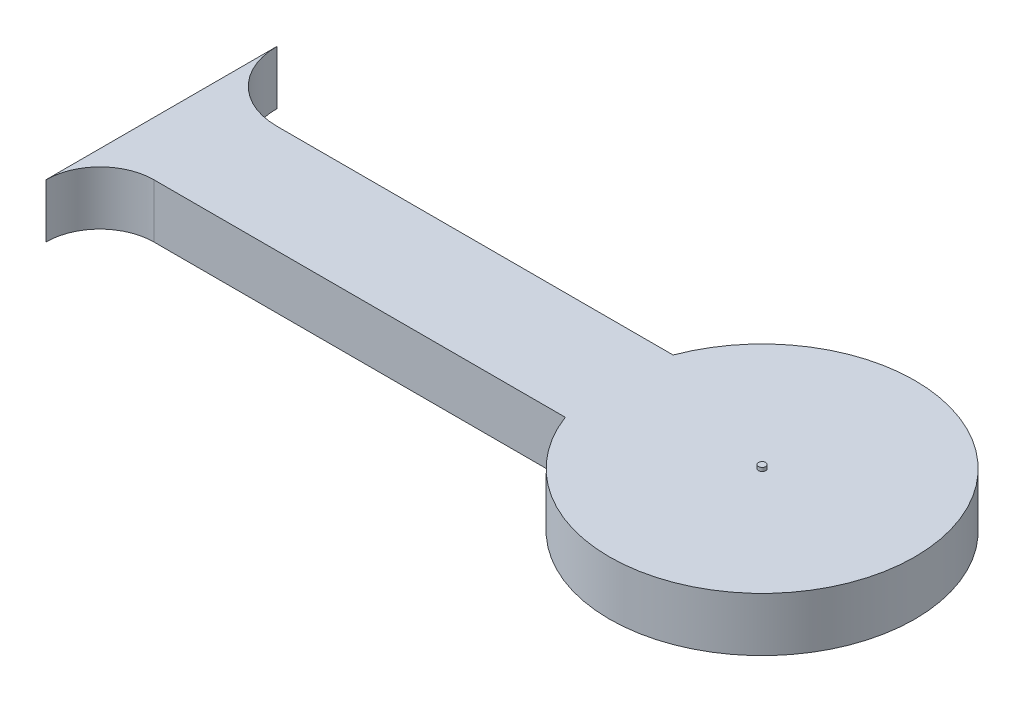
ISO-10303-21;
HEADER;
FILE_DESCRIPTION(('STEP AP214'),'2;1');
FILE_NAME('part.step','',(''),(''),'','','');
FILE_SCHEMA(('AUTOMOTIVE_DESIGN { 1 0 10303 214 1 1 1 1 }'));
ENDSEC;
DATA;
#1=APPLICATION_CONTEXT('core data for automotive mechanical design processes');
#2=APPLICATION_PROTOCOL_DEFINITION('international standard','automotive_design',2000,#1);
#3=PRODUCT_CONTEXT('',#1,'mechanical');
#4=PRODUCT('Part','Part','',(#3));
#5=PRODUCT_RELATED_PRODUCT_CATEGORY('part','',(#4));
#6=PRODUCT_DEFINITION_FORMATION('','',#4);
#7=PRODUCT_DEFINITION_CONTEXT('part definition',#1,'design');
#8=PRODUCT_DEFINITION('design','',#6,#7);
#9=PRODUCT_DEFINITION_SHAPE('','',#8);
#10=(LENGTH_UNIT() NAMED_UNIT(*) SI_UNIT(.MILLI.,.METRE.));
#11=(NAMED_UNIT(*) PLANE_ANGLE_UNIT() SI_UNIT($,.RADIAN.));
#12=(NAMED_UNIT(*) SI_UNIT($,.STERADIAN.) SOLID_ANGLE_UNIT());
#13=UNCERTAINTY_MEASURE_WITH_UNIT(LENGTH_MEASURE(1.E-05),#10,'distance_accuracy_value','');
#14=(GEOMETRIC_REPRESENTATION_CONTEXT(3) GLOBAL_UNCERTAINTY_ASSIGNED_CONTEXT((#13)) GLOBAL_UNIT_ASSIGNED_CONTEXT((#10,
#11,#12)) REPRESENTATION_CONTEXT('',''));
#15=CARTESIAN_POINT('',(0.,0.,0.));
#16=DIRECTION('',(0.,0.,1.));
#17=DIRECTION('',(1.,0.,0.));
#18=AXIS2_PLACEMENT_3D('',#15,#16,#17);
#19=CARTESIAN_POINT('',(0.,1.5,0.));
#20=DIRECTION('',(0.,1.,0.));
#21=DIRECTION('',(0.,0.,1.));
#22=AXIS2_PLACEMENT_3D('',#19,#20,#21);
#23=PLANE('',#22);
#24=CARTESIAN_POINT('',(0.,1.5,0.));
#25=DIRECTION('',(0.,1.,0.));
#26=DIRECTION('',(0.,0.,1.));
#27=AXIS2_PLACEMENT_3D('',#24,#25,#26);
#28=CIRCLE('',#27,4.25);
#29=CARTESIAN_POINT('',(-3.97649343014672,1.5,1.5));
#30=VERTEX_POINT('',#29);
#31=CARTESIAN_POINT('',(-3.97649343014672,1.5,-1.5));
#32=VERTEX_POINT('',#31);
#33=EDGE_CURVE('E137',#30,#32,#28,.T.);
#34=ORIENTED_EDGE('',*,*,#33,.T.);
#35=DIRECTION('',(-1.,0.,0.));
#36=VECTOR('',#35,1.);
#37=CARTESIAN_POINT('',(-3.97649343014672,1.5,-1.5));
#38=LINE('',#37,#36);
#39=CARTESIAN_POINT('',(-15.,1.5,-1.5));
#40=VERTEX_POINT('',#39);
#41=EDGE_CURVE('E95',#32,#40,#38,.T.);
#42=ORIENTED_EDGE('',*,*,#41,.T.);
#43=CARTESIAN_POINT('',(-15.,1.5,-3.42168297413927));
#44=DIRECTION('',(0.,-1.,0.));
#45=DIRECTION('',(0.,0.,1.));
#46=AXIS2_PLACEMENT_3D('',#43,#44,#45);
#47=CIRCLE('',#46,1.92168297413927);
#48=CARTESIAN_POINT('',(-16.9216829741393,1.5,-3.42168297413927));
#49=VERTEX_POINT('',#48);
#50=EDGE_CURVE('E108',#40,#49,#47,.T.);
#51=ORIENTED_EDGE('',*,*,#50,.T.);
#52=DIRECTION('',(0.,0.,1.));
#53=VECTOR('',#52,1.);
#54=CARTESIAN_POINT('',(-16.9216829741393,1.5,-3.42168297413927));
#55=LINE('',#54,#53);
#56=CARTESIAN_POINT('',(-16.9216829741393,1.5,3.));
#57=VERTEX_POINT('',#56);
#58=EDGE_CURVE('E102',#49,#57,#55,.T.);
#59=ORIENTED_EDGE('',*,*,#58,.T.);
#60=CARTESIAN_POINT('',(-15.4216829741393,1.5,3.));
#61=DIRECTION('',(0.,-1.,0.));
#62=DIRECTION('',(0.,0.,1.));
#63=AXIS2_PLACEMENT_3D('',#60,#61,#62);
#64=CIRCLE('',#63,1.5);
#65=CARTESIAN_POINT('',(-15.4216829741393,1.5,1.5));
#66=VERTEX_POINT('',#65);
#67=EDGE_CURVE('E106',#57,#66,#64,.T.);
#68=ORIENTED_EDGE('',*,*,#67,.T.);
#69=DIRECTION('',(1.,0.,0.));
#70=VECTOR('',#69,1.);
#71=CARTESIAN_POINT('',(-3.97649343014672,1.5,1.5));
#72=LINE('',#71,#70);
#73=EDGE_CURVE('E58',#66,#30,#72,.T.);
#74=ORIENTED_EDGE('',*,*,#73,.T.);
#75=EDGE_LOOP('',(#34,#42,#51,#59,#68,#74));
#76=FACE_BOUND('',#75,.T.);
#77=CARTESIAN_POINT('',(0.,1.5,0.));
#78=DIRECTION('',(0.,1.,0.));
#79=DIRECTION('',(0.,0.,1.));
#80=AXIS2_PLACEMENT_3D('',#77,#78,#79);
#81=CIRCLE('',#80,0.1);
#82=CARTESIAN_POINT('',(0.,1.5,0.1));
#83=VERTEX_POINT('',#82);
#84=EDGE_CURVE('E177',#83,#83,#81,.T.);
#85=ORIENTED_EDGE('',*,*,#84,.F.);
#86=EDGE_LOOP('',(#85));
#87=FACE_BOUND('',#86,.T.);
#88=ADVANCED_FACE('F41',(#76,#87),#23,.T.);
#89=CARTESIAN_POINT('',(0.,1.5,0.));
#90=DIRECTION('',(0.,-1.,0.));
#91=DIRECTION('',(0.,0.,-1.));
#92=AXIS2_PLACEMENT_3D('',#89,#90,#91);
#93=CYLINDRICAL_SURFACE('',#92,4.25);
#94=CARTESIAN_POINT('',(0.,0.,0.));
#95=DIRECTION('',(0.,1.,0.));
#96=DIRECTION('',(0.,0.,1.));
#97=AXIS2_PLACEMENT_3D('',#94,#95,#96);
#98=CIRCLE('',#97,4.25);
#99=CARTESIAN_POINT('',(-3.97649343014672,0.,1.5));
#100=VERTEX_POINT('',#99);
#101=CARTESIAN_POINT('',(-3.97649343014672,0.,-1.5));
#102=VERTEX_POINT('',#101);
#103=EDGE_CURVE('E126',#100,#102,#98,.T.);
#104=ORIENTED_EDGE('',*,*,#103,.T.);
#105=DIRECTION('',(0.,-1.,0.));
#106=VECTOR('',#105,1.);
#107=CARTESIAN_POINT('',(-3.97649343014672,1.5,-1.5));
#108=LINE('',#107,#106);
#109=EDGE_CURVE('E11',#32,#102,#108,.T.);
#110=ORIENTED_EDGE('',*,*,#109,.F.);
#111=ORIENTED_EDGE('',*,*,#33,.F.);
#112=DIRECTION('',(0.,-1.,0.));
#113=VECTOR('',#112,1.);
#114=CARTESIAN_POINT('',(-3.97649343014672,1.5,1.5));
#115=LINE('',#114,#113);
#116=EDGE_CURVE('E122',#30,#100,#115,.T.);
#117=ORIENTED_EDGE('',*,*,#116,.T.);
#118=EDGE_LOOP('',(#104,#110,#111,#117));
#119=FACE_BOUND('',#118,.T.);
#120=ADVANCED_FACE('F43',(#119),#93,.T.);
#121=CARTESIAN_POINT('',(-3.97649343014672,1.5,-1.5));
#122=DIRECTION('',(0.,0.,1.));
#123=DIRECTION('',(1.,0.,0.));
#124=AXIS2_PLACEMENT_3D('',#121,#122,#123);
#125=PLANE('',#124);
#126=DIRECTION('',(-1.,0.,0.));
#127=VECTOR('',#126,1.);
#128=CARTESIAN_POINT('',(-3.97649343014672,0.,-1.5));
#129=LINE('',#128,#127);
#130=CARTESIAN_POINT('',(-15.,0.,-1.5));
#131=VERTEX_POINT('',#130);
#132=EDGE_CURVE('E129',#102,#131,#129,.T.);
#133=ORIENTED_EDGE('',*,*,#132,.T.);
#134=DIRECTION('',(0.,-1.,0.));
#135=VECTOR('',#134,1.);
#136=CARTESIAN_POINT('',(-15.,1.5,-1.5));
#137=LINE('',#136,#135);
#138=EDGE_CURVE('E50',#40,#131,#137,.T.);
#139=ORIENTED_EDGE('',*,*,#138,.F.);
#140=ORIENTED_EDGE('',*,*,#41,.F.);
#141=ORIENTED_EDGE('',*,*,#109,.T.);
#142=EDGE_LOOP('',(#133,#139,#140,#141));
#143=FACE_BOUND('',#142,.T.);
#144=ADVANCED_FACE('F165',(#143),#125,.F.);
#145=CARTESIAN_POINT('',(-15.,1.5,-3.42168297413927));
#146=DIRECTION('',(0.,-1.,0.));
#147=DIRECTION('',(0.,0.,-1.));
#148=AXIS2_PLACEMENT_3D('',#145,#146,#147);
#149=CYLINDRICAL_SURFACE('',#148,1.92168297413927);
#150=CARTESIAN_POINT('',(-15.,0.,-3.42168297413927));
#151=DIRECTION('',(0.,-1.,0.));
#152=DIRECTION('',(0.,0.,1.));
#153=AXIS2_PLACEMENT_3D('',#150,#151,#152);
#154=CIRCLE('',#153,1.92168297413927);
#155=CARTESIAN_POINT('',(-16.9216829741393,0.,-3.42168297413927));
#156=VERTEX_POINT('',#155);
#157=EDGE_CURVE('E132',#131,#156,#154,.T.);
#158=ORIENTED_EDGE('',*,*,#157,.T.);
#159=DIRECTION('',(0.,-1.,0.));
#160=VECTOR('',#159,1.);
#161=CARTESIAN_POINT('',(-16.9216829741393,1.5,-3.42168297413927));
#162=LINE('',#161,#160);
#163=EDGE_CURVE('E117',#49,#156,#162,.T.);
#164=ORIENTED_EDGE('',*,*,#163,.F.);
#165=ORIENTED_EDGE('',*,*,#50,.F.);
#166=ORIENTED_EDGE('',*,*,#138,.T.);
#167=EDGE_LOOP('',(#158,#164,#165,#166));
#168=FACE_BOUND('',#167,.T.);
#169=ADVANCED_FACE('F143',(#168),#149,.F.);
#170=CARTESIAN_POINT('',(-16.9216829741393,1.5,-3.42168297413927));
#171=DIRECTION('',(1.,0.,0.));
#172=DIRECTION('',(0.,0.,-1.));
#173=AXIS2_PLACEMENT_3D('',#170,#171,#172);
#174=PLANE('',#173);
#175=DIRECTION('',(0.,0.,1.));
#176=VECTOR('',#175,1.);
#177=CARTESIAN_POINT('',(-16.9216829741393,0.,-3.42168297413927));
#178=LINE('',#177,#176);
#179=CARTESIAN_POINT('',(-16.9216829741393,0.,3.));
#180=VERTEX_POINT('',#179);
#181=EDGE_CURVE('E116',#156,#180,#178,.T.);
#182=ORIENTED_EDGE('',*,*,#181,.T.);
#183=DIRECTION('',(0.,-1.,0.));
#184=VECTOR('',#183,1.);
#185=CARTESIAN_POINT('',(-16.9216829741393,1.5,3.));
#186=LINE('',#185,#184);
#187=EDGE_CURVE('E113',#57,#180,#186,.T.);
#188=ORIENTED_EDGE('',*,*,#187,.F.);
#189=ORIENTED_EDGE('',*,*,#58,.F.);
#190=ORIENTED_EDGE('',*,*,#163,.T.);
#191=EDGE_LOOP('',(#182,#188,#189,#190));
#192=FACE_BOUND('',#191,.T.);
#193=ADVANCED_FACE('F114',(#192),#174,.F.);
#194=CARTESIAN_POINT('',(-15.4216829741393,1.5,3.));
#195=DIRECTION('',(0.,-1.,0.));
#196=DIRECTION('',(0.,0.,-1.));
#197=AXIS2_PLACEMENT_3D('',#194,#195,#196);
#198=CYLINDRICAL_SURFACE('',#197,1.5);
#199=CARTESIAN_POINT('',(-15.4216829741393,0.,3.));
#200=DIRECTION('',(0.,-1.,0.));
#201=DIRECTION('',(0.,0.,1.));
#202=AXIS2_PLACEMENT_3D('',#199,#200,#201);
#203=CIRCLE('',#202,1.5);
#204=CARTESIAN_POINT('',(-15.4216829741393,0.,1.5));
#205=VERTEX_POINT('',#204);
#206=EDGE_CURVE('E81',#180,#205,#203,.T.);
#207=ORIENTED_EDGE('',*,*,#206,.T.);
#208=DIRECTION('',(0.,-1.,0.));
#209=VECTOR('',#208,1.);
#210=CARTESIAN_POINT('',(-15.4216829741393,1.5,1.5));
#211=LINE('',#210,#209);
#212=EDGE_CURVE('E118',#66,#205,#211,.T.);
#213=ORIENTED_EDGE('',*,*,#212,.F.);
#214=ORIENTED_EDGE('',*,*,#67,.F.);
#215=ORIENTED_EDGE('',*,*,#187,.T.);
#216=EDGE_LOOP('',(#207,#213,#214,#215));
#217=FACE_BOUND('',#216,.T.);
#218=ADVANCED_FACE('F120',(#217),#198,.F.);
#219=CARTESIAN_POINT('',(-3.97649343014672,1.5,1.5));
#220=DIRECTION('',(0.,0.,-1.));
#221=DIRECTION('',(-1.,0.,0.));
#222=AXIS2_PLACEMENT_3D('',#219,#220,#221);
#223=PLANE('',#222);
#224=DIRECTION('',(1.,0.,0.));
#225=VECTOR('',#224,1.);
#226=CARTESIAN_POINT('',(-3.97649343014672,0.,1.5));
#227=LINE('',#226,#225);
#228=EDGE_CURVE('E87',#205,#100,#227,.T.);
#229=ORIENTED_EDGE('',*,*,#228,.T.);
#230=ORIENTED_EDGE('',*,*,#116,.F.);
#231=ORIENTED_EDGE('',*,*,#73,.F.);
#232=ORIENTED_EDGE('',*,*,#212,.T.);
#233=EDGE_LOOP('',(#229,#230,#231,#232));
#234=FACE_BOUND('',#233,.T.);
#235=ADVANCED_FACE('F150',(#234),#223,.F.);
#236=CARTESIAN_POINT('',(0.,0.,0.));
#237=DIRECTION('',(0.,1.,0.));
#238=DIRECTION('',(0.,0.,1.));
#239=AXIS2_PLACEMENT_3D('',#236,#237,#238);
#240=PLANE('',#239);
#241=ORIENTED_EDGE('',*,*,#103,.F.);
#242=ORIENTED_EDGE('',*,*,#228,.F.);
#243=ORIENTED_EDGE('',*,*,#206,.F.);
#244=ORIENTED_EDGE('',*,*,#181,.F.);
#245=ORIENTED_EDGE('',*,*,#157,.F.);
#246=ORIENTED_EDGE('',*,*,#132,.F.);
#247=EDGE_LOOP('',(#241,#242,#243,#244,#245,#246));
#248=FACE_BOUND('',#247,.T.);
#249=ADVANCED_FACE('F146',(#248),#240,.F.);
#250=CARTESIAN_POINT('',(0.,1.6,0.));
#251=DIRECTION('',(0.,-1.,0.));
#252=DIRECTION('',(0.,0.,-1.));
#253=AXIS2_PLACEMENT_3D('',#250,#251,#252);
#254=CYLINDRICAL_SURFACE('',#253,0.1);
#255=CARTESIAN_POINT('',(0.,1.6,0.));
#256=DIRECTION('',(0.,1.,0.));
#257=DIRECTION('',(0.,0.,1.));
#258=AXIS2_PLACEMENT_3D('',#255,#256,#257);
#259=CIRCLE('',#258,0.1);
#260=CARTESIAN_POINT('',(0.,1.6,0.1));
#261=VERTEX_POINT('',#260);
#262=EDGE_CURVE('E130',#261,#261,#259,.T.);
#263=ORIENTED_EDGE('',*,*,#262,.F.);
#264=EDGE_LOOP('',(#263));
#265=FACE_BOUND('',#264,.T.);
#266=ORIENTED_EDGE('',*,*,#84,.T.);
#267=EDGE_LOOP('',(#266));
#268=FACE_BOUND('',#267,.T.);
#269=ADVANCED_FACE('F157',(#265,#268),#254,.T.);
#270=CARTESIAN_POINT('',(0.,1.6,0.));
#271=DIRECTION('',(0.,1.,0.));
#272=DIRECTION('',(0.,0.,1.));
#273=AXIS2_PLACEMENT_3D('',#270,#271,#272);
#274=PLANE('',#273);
#275=ORIENTED_EDGE('',*,*,#262,.T.);
#276=EDGE_LOOP('',(#275));
#277=FACE_BOUND('',#276,.T.);
#278=ADVANCED_FACE('F169',(#277),#274,.T.);
#279=CLOSED_SHELL('',(#88,#120,#144,#169,#193,#218,#235,#249,#269,#278));
#280=MANIFOLD_SOLID_BREP('B2',#279);
#281=ADVANCED_BREP_SHAPE_REPRESENTATION('',(#18,#280),#14);
#282=SHAPE_DEFINITION_REPRESENTATION(#9,#281);
ENDSEC;
END-ISO-10303-21;
